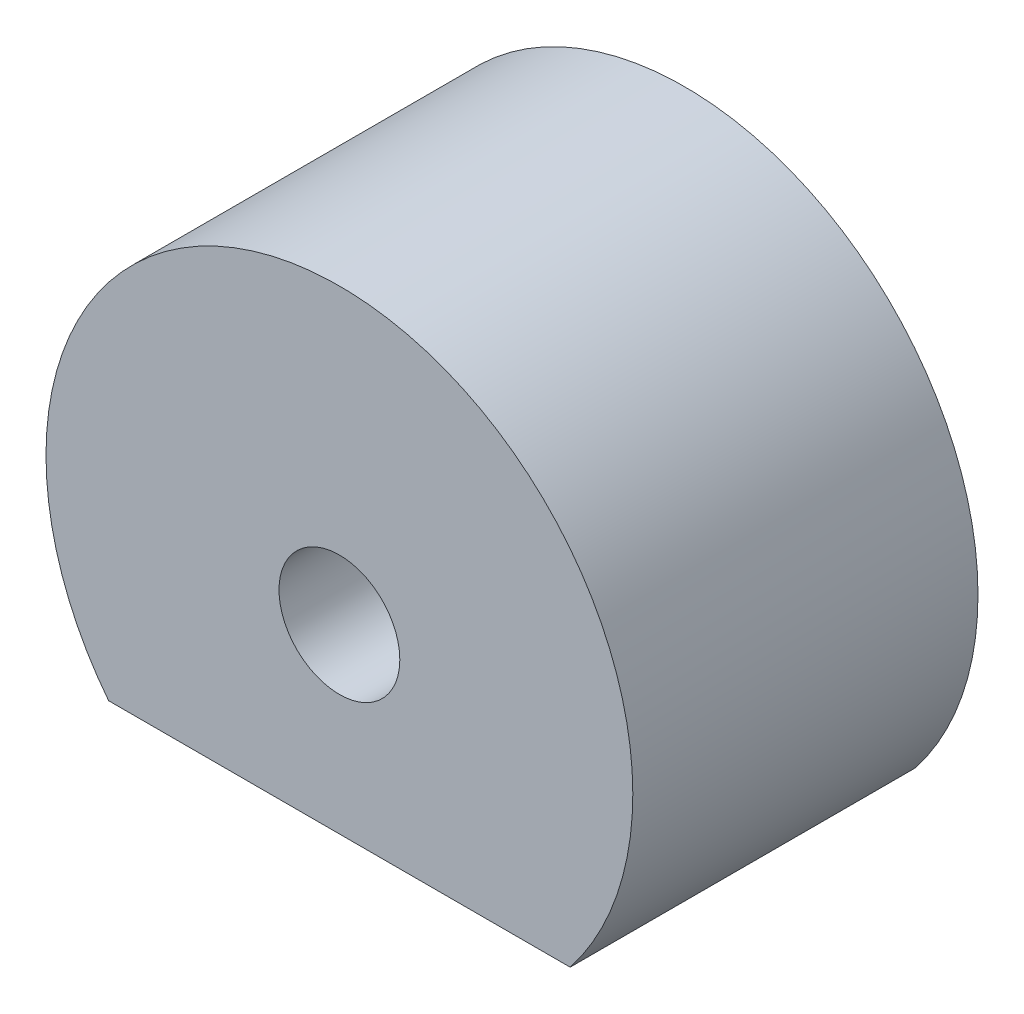
ISO-10303-21;
HEADER;
FILE_DESCRIPTION(('STEP AP214'),'2;1');
FILE_NAME('part.step','',(''),(''),'','','');
FILE_SCHEMA(('AUTOMOTIVE_DESIGN { 1 0 10303 214 1 1 1 1 }'));
ENDSEC;
DATA;
#1=APPLICATION_CONTEXT('core data for automotive mechanical design processes');
#2=APPLICATION_PROTOCOL_DEFINITION('international standard','automotive_design',2000,#1);
#3=PRODUCT_CONTEXT('',#1,'mechanical');
#4=PRODUCT('Part','Part','',(#3));
#5=PRODUCT_RELATED_PRODUCT_CATEGORY('part','',(#4));
#6=PRODUCT_DEFINITION_FORMATION('','',#4);
#7=PRODUCT_DEFINITION_CONTEXT('part definition',#1,'design');
#8=PRODUCT_DEFINITION('design','',#6,#7);
#9=PRODUCT_DEFINITION_SHAPE('','',#8);
#10=(LENGTH_UNIT() NAMED_UNIT(*) SI_UNIT(.MILLI.,.METRE.));
#11=(NAMED_UNIT(*) PLANE_ANGLE_UNIT() SI_UNIT($,.RADIAN.));
#12=(NAMED_UNIT(*) SI_UNIT($,.STERADIAN.) SOLID_ANGLE_UNIT());
#13=UNCERTAINTY_MEASURE_WITH_UNIT(LENGTH_MEASURE(1.E-05),#10,'distance_accuracy_value','');
#14=(GEOMETRIC_REPRESENTATION_CONTEXT(3) GLOBAL_UNCERTAINTY_ASSIGNED_CONTEXT((#13)) GLOBAL_UNIT_ASSIGNED_CONTEXT((#10,
#11,#12)) REPRESENTATION_CONTEXT('',''));
#15=CARTESIAN_POINT('',(0.,0.,0.));
#16=DIRECTION('',(0.,0.,1.));
#17=DIRECTION('',(1.,0.,0.));
#18=AXIS2_PLACEMENT_3D('',#15,#16,#17);
#19=CARTESIAN_POINT('',(60.2248388753379,-16.8924883192061,71.6));
#20=DIRECTION('',(0.,0.,1.));
#21=DIRECTION('',(1.,0.,0.));
#22=AXIS2_PLACEMENT_3D('',#19,#20,#21);
#23=PLANE('',#22);
#24=CARTESIAN_POINT('',(50.1294434949154,-15.5776526520014,71.6));
#25=DIRECTION('',(0.,0.,1.));
#26=DIRECTION('',(1.,0.,0.));
#27=AXIS2_PLACEMENT_3D('',#24,#25,#26);
#28=CIRCLE('',#27,8.5);
#29=CARTESIAN_POINT('',(56.8143144734759,-20.8276526520014,71.6));
#30=VERTEX_POINT('',#29);
#31=CARTESIAN_POINT('',(43.444572516355,-20.8276526520014,71.6));
#32=VERTEX_POINT('',#31);
#33=EDGE_CURVE('E64',#30,#32,#28,.T.);
#34=ORIENTED_EDGE('',*,*,#33,.F.);
#35=DIRECTION('',(1.,0.,0.));
#36=VECTOR('',#35,1.);
#37=CARTESIAN_POINT('',(50.1294434949154,-20.8276526520014,71.6));
#38=LINE('',#37,#36);
#39=EDGE_CURVE('E27',#32,#30,#38,.T.);
#40=ORIENTED_EDGE('',*,*,#39,.F.);
#41=EDGE_LOOP('',(#34,#40));
#42=FACE_BOUND('',#41,.T.);
#43=CARTESIAN_POINT('',(50.1294434949154,-15.5776526520014,71.6));
#44=DIRECTION('',(0.,0.,1.));
#45=DIRECTION('',(1.,0.,0.));
#46=AXIS2_PLACEMENT_3D('',#43,#44,#45);
#47=CIRCLE('',#46,1.75);
#48=CARTESIAN_POINT('',(51.8794434949154,-15.5776526520014,71.6));
#49=VERTEX_POINT('',#48);
#50=EDGE_CURVE('E38',#49,#49,#47,.T.);
#51=ORIENTED_EDGE('',*,*,#50,.T.);
#52=EDGE_LOOP('',(#51));
#53=FACE_BOUND('',#52,.T.);
#54=ADVANCED_FACE('F17',(#42,#53),#23,.F.);
#55=CARTESIAN_POINT('',(60.2248388753379,-16.8924883192061,81.6));
#56=DIRECTION('',(0.,0.,1.));
#57=DIRECTION('',(1.,0.,0.));
#58=AXIS2_PLACEMENT_3D('',#55,#56,#57);
#59=PLANE('',#58);
#60=CARTESIAN_POINT('',(50.1294434949154,-15.5776526520014,81.6));
#61=DIRECTION('',(0.,0.,1.));
#62=DIRECTION('',(1.,0.,0.));
#63=AXIS2_PLACEMENT_3D('',#60,#61,#62);
#64=CIRCLE('',#63,8.5);
#65=CARTESIAN_POINT('',(56.8143144734759,-20.8276526520014,81.6));
#66=VERTEX_POINT('',#65);
#67=CARTESIAN_POINT('',(43.444572516355,-20.8276526520014,81.6));
#68=VERTEX_POINT('',#67);
#69=EDGE_CURVE('E75',#66,#68,#64,.T.);
#70=ORIENTED_EDGE('',*,*,#69,.T.);
#71=DIRECTION('',(1.,0.,0.));
#72=VECTOR('',#71,1.);
#73=CARTESIAN_POINT('',(50.1294434949154,-20.8276526520014,81.6));
#74=LINE('',#73,#72);
#75=EDGE_CURVE('E11',#68,#66,#74,.T.);
#76=ORIENTED_EDGE('',*,*,#75,.T.);
#77=EDGE_LOOP('',(#70,#76));
#78=FACE_BOUND('',#77,.T.);
#79=CARTESIAN_POINT('',(50.1294434949154,-15.5776526520014,81.6));
#80=DIRECTION('',(0.,0.,1.));
#81=DIRECTION('',(1.,0.,0.));
#82=AXIS2_PLACEMENT_3D('',#79,#80,#81);
#83=CIRCLE('',#82,1.75);
#84=CARTESIAN_POINT('',(51.8794434949154,-15.5776526520014,81.6));
#85=VERTEX_POINT('',#84);
#86=EDGE_CURVE('E45',#85,#85,#83,.T.);
#87=ORIENTED_EDGE('',*,*,#86,.F.);
#88=EDGE_LOOP('',(#87));
#89=FACE_BOUND('',#88,.T.);
#90=ADVANCED_FACE('F97',(#78,#89),#59,.T.);
#91=CARTESIAN_POINT('',(50.1294434949154,-20.8276526520014,81.6));
#92=DIRECTION('',(0.,1.,0.));
#93=DIRECTION('',(1.,0.,0.));
#94=AXIS2_PLACEMENT_3D('',#91,#92,#93);
#95=PLANE('',#94);
#96=ORIENTED_EDGE('',*,*,#39,.T.);
#97=DIRECTION('',(0.,0.,-1.));
#98=VECTOR('',#97,1.);
#99=CARTESIAN_POINT('',(56.8143144734759,-20.8276526520014,81.6));
#100=LINE('',#99,#98);
#101=EDGE_CURVE('E77',#66,#30,#100,.T.);
#102=ORIENTED_EDGE('',*,*,#101,.F.);
#103=ORIENTED_EDGE('',*,*,#75,.F.);
#104=DIRECTION('',(0.,0.,-1.));
#105=VECTOR('',#104,1.);
#106=CARTESIAN_POINT('',(43.444572516355,-20.8276526520014,81.6));
#107=LINE('',#106,#105);
#108=EDGE_CURVE('E21',#68,#32,#107,.T.);
#109=ORIENTED_EDGE('',*,*,#108,.T.);
#110=EDGE_LOOP('',(#96,#102,#103,#109));
#111=FACE_BOUND('',#110,.T.);
#112=ADVANCED_FACE('F19',(#111),#95,.F.);
#113=CARTESIAN_POINT('',(50.1294434949154,-15.5776526520014,81.6));
#114=DIRECTION('',(0.,0.,-1.));
#115=DIRECTION('',(-1.,0.,0.));
#116=AXIS2_PLACEMENT_3D('',#113,#114,#115);
#117=CYLINDRICAL_SURFACE('',#116,1.75);
#118=ORIENTED_EDGE('',*,*,#50,.F.);
#119=EDGE_LOOP('',(#118));
#120=FACE_BOUND('',#119,.T.);
#121=ORIENTED_EDGE('',*,*,#86,.T.);
#122=EDGE_LOOP('',(#121));
#123=FACE_BOUND('',#122,.T.);
#124=ADVANCED_FACE('F105',(#120,#123),#117,.F.);
#125=CARTESIAN_POINT('',(50.1294434949154,-15.5776526520014,81.6));
#126=DIRECTION('',(0.,0.,-1.));
#127=DIRECTION('',(-1.,0.,0.));
#128=AXIS2_PLACEMENT_3D('',#125,#126,#127);
#129=CYLINDRICAL_SURFACE('',#128,8.5);
#130=ORIENTED_EDGE('',*,*,#33,.T.);
#131=ORIENTED_EDGE('',*,*,#108,.F.);
#132=ORIENTED_EDGE('',*,*,#69,.F.);
#133=ORIENTED_EDGE('',*,*,#101,.T.);
#134=EDGE_LOOP('',(#130,#131,#132,#133));
#135=FACE_BOUND('',#134,.T.);
#136=ADVANCED_FACE('F76',(#135),#129,.T.);
#137=CLOSED_SHELL('',(#54,#90,#112,#124,#136));
#138=MANIFOLD_SOLID_BREP('B1',#137);
#139=ADVANCED_BREP_SHAPE_REPRESENTATION('',(#18,#138),#14);
#140=SHAPE_DEFINITION_REPRESENTATION(#9,#139);
ENDSEC;
END-ISO-10303-21;
